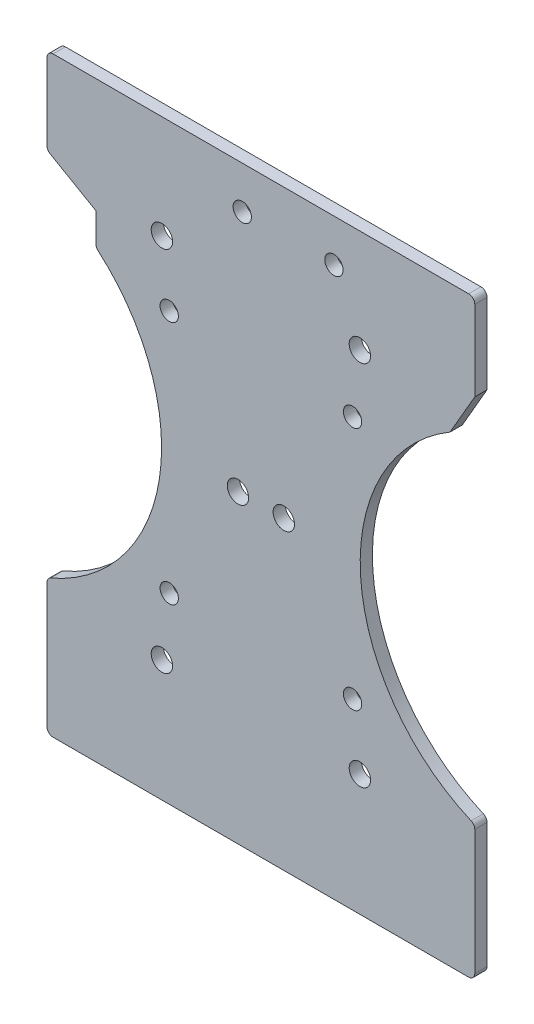
ISO-10303-21;
HEADER;
FILE_DESCRIPTION(('STEP AP214'),'2;1');
FILE_NAME('part.step','',(''),(''),'','','');
FILE_SCHEMA(('AUTOMOTIVE_DESIGN { 1 0 10303 214 1 1 1 1 }'));
ENDSEC;
DATA;
#1=APPLICATION_CONTEXT('core data for automotive mechanical design processes');
#2=APPLICATION_PROTOCOL_DEFINITION('international standard','automotive_design',2000,#1);
#3=PRODUCT_CONTEXT('',#1,'mechanical');
#4=PRODUCT('Part','Part','',(#3));
#5=PRODUCT_RELATED_PRODUCT_CATEGORY('part','',(#4));
#6=PRODUCT_DEFINITION_FORMATION('','',#4);
#7=PRODUCT_DEFINITION_CONTEXT('part definition',#1,'design');
#8=PRODUCT_DEFINITION('design','',#6,#7);
#9=PRODUCT_DEFINITION_SHAPE('','',#8);
#10=(LENGTH_UNIT() NAMED_UNIT(*) SI_UNIT(.MILLI.,.METRE.));
#11=(NAMED_UNIT(*) PLANE_ANGLE_UNIT() SI_UNIT($,.RADIAN.));
#12=(NAMED_UNIT(*) SI_UNIT($,.STERADIAN.) SOLID_ANGLE_UNIT());
#13=UNCERTAINTY_MEASURE_WITH_UNIT(LENGTH_MEASURE(1.E-05),#10,'distance_accuracy_value','');
#14=(GEOMETRIC_REPRESENTATION_CONTEXT(3) GLOBAL_UNCERTAINTY_ASSIGNED_CONTEXT((#13)) GLOBAL_UNIT_ASSIGNED_CONTEXT((#10,
#11,#12)) REPRESENTATION_CONTEXT('',''));
#15=CARTESIAN_POINT('',(0.,0.,0.));
#16=DIRECTION('',(0.,0.,1.));
#17=DIRECTION('',(1.,0.,0.));
#18=AXIS2_PLACEMENT_3D('',#15,#16,#17);
#19=CARTESIAN_POINT('',(46.25,0.,2.));
#20=DIRECTION('',(0.,0.,-1.));
#21=DIRECTION('',(-1.,0.,0.));
#22=AXIS2_PLACEMENT_3D('',#19,#20,#21);
#23=CYLINDRICAL_SURFACE('',#22,30.);
#24=CARTESIAN_POINT('',(46.25,0.,2.));
#25=DIRECTION('',(0.,0.,1.));
#26=DIRECTION('',(1.,0.,0.));
#27=AXIS2_PLACEMENT_3D('',#24,#25,#26);
#28=CIRCLE('',#27,30.);
#29=CARTESIAN_POINT('',(30.9581567377026,25.8100664400797,2.));
#30=VERTEX_POINT('',#29);
#31=CARTESIAN_POINT('',(34.3951612903226,-27.5583526207125,2.));
#32=VERTEX_POINT('',#31);
#33=EDGE_CURVE('E176',#30,#32,#28,.T.);
#34=ORIENTED_EDGE('',*,*,#33,.T.);
#35=DIRECTION('',(0.,0.,-1.));
#36=VECTOR('',#35,1.);
#37=CARTESIAN_POINT('',(34.3951612903226,-27.5583526207125,2.));
#38=LINE('',#37,#36);
#39=CARTESIAN_POINT('',(34.3951612903226,-27.5583526207125,0.));
#40=VERTEX_POINT('',#39);
#41=EDGE_CURVE('E184',#32,#40,#38,.T.);
#42=ORIENTED_EDGE('',*,*,#41,.T.);
#43=CARTESIAN_POINT('',(46.25,0.,0.));
#44=DIRECTION('',(0.,0.,1.));
#45=DIRECTION('',(1.,0.,0.));
#46=AXIS2_PLACEMENT_3D('',#43,#44,#45);
#47=CIRCLE('',#46,30.);
#48=CARTESIAN_POINT('',(30.9581567377026,25.8100664400797,0.));
#49=VERTEX_POINT('',#48);
#50=EDGE_CURVE('E179',#49,#40,#47,.T.);
#51=ORIENTED_EDGE('',*,*,#50,.F.);
#52=DIRECTION('',(0.,0.,-1.));
#53=VECTOR('',#52,1.);
#54=CARTESIAN_POINT('',(30.9581567377026,25.8100664400797,2.));
#55=LINE('',#54,#53);
#56=EDGE_CURVE('E173',#30,#49,#55,.T.);
#57=ORIENTED_EDGE('',*,*,#56,.F.);
#58=EDGE_LOOP('',(#34,#42,#51,#57));
#59=FACE_BOUND('',#58,.T.);
#60=ADVANCED_FACE('F41',(#59),#23,.F.);
#61=CARTESIAN_POINT('',(12.0425309480404,-6.9527584845755,2.));
#62=DIRECTION('',(0.86602540378444,-0.499999999999998,0.));
#63=DIRECTION('',(0.499999999999998,0.86602540378444,0.));
#64=AXIS2_PLACEMENT_3D('',#61,#62,#63);
#65=PLANE('',#64);
#66=DIRECTION('',(-0.499999999999998,-0.86602540378444,0.));
#67=VECTOR('',#66,1.);
#68=CARTESIAN_POINT('',(12.0425309480404,-6.9527584845755,0.));
#69=LINE('',#68,#67);
#70=CARTESIAN_POINT('',(35.0000000000001,32.8107443266089,0.));
#71=VERTEX_POINT('',#70);
#72=EDGE_CURVE('E250',#71,#49,#69,.T.);
#73=ORIENTED_EDGE('',*,*,#72,.F.);
#74=DIRECTION('',(0.,0.,-1.));
#75=VECTOR('',#74,1.);
#76=CARTESIAN_POINT('',(35.0000000000001,32.8107443266089,2.));
#77=LINE('',#76,#75);
#78=CARTESIAN_POINT('',(35.0000000000001,32.8107443266089,2.));
#79=VERTEX_POINT('',#78);
#80=EDGE_CURVE('E185',#79,#71,#77,.T.);
#81=ORIENTED_EDGE('',*,*,#80,.F.);
#82=DIRECTION('',(-0.499999999999998,-0.86602540378444,0.));
#83=VECTOR('',#82,1.);
#84=CARTESIAN_POINT('',(12.0425309480404,-6.9527584845755,2.));
#85=LINE('',#84,#83);
#86=EDGE_CURVE('E191',#79,#30,#85,.T.);
#87=ORIENTED_EDGE('',*,*,#86,.T.);
#88=ORIENTED_EDGE('',*,*,#56,.T.);
#89=EDGE_LOOP('',(#73,#81,#87,#88));
#90=FACE_BOUND('',#89,.T.);
#91=ADVANCED_FACE('F197',(#90),#65,.T.);
#92=CARTESIAN_POINT('',(35.,0.,2.));
#93=DIRECTION('',(1.,0.,0.));
#94=DIRECTION('',(0.,1.,0.));
#95=AXIS2_PLACEMENT_3D('',#92,#93,#94);
#96=PLANE('',#95);
#97=DIRECTION('',(0.,-1.,0.));
#98=VECTOR('',#97,1.);
#99=CARTESIAN_POINT('',(35.,0.,0.));
#100=LINE('',#99,#98);
#101=CARTESIAN_POINT('',(35.0000000000001,45.9201449273124,0.));
#102=VERTEX_POINT('',#101);
#103=EDGE_CURVE('E252',#102,#71,#100,.T.);
#104=ORIENTED_EDGE('',*,*,#103,.F.);
#105=DIRECTION('',(0.,0.,-1.));
#106=VECTOR('',#105,1.);
#107=CARTESIAN_POINT('',(35.0000000000001,45.9201449273124,2.));
#108=LINE('',#107,#106);
#109=CARTESIAN_POINT('',(35.0000000000001,45.9201449273124,2.));
#110=VERTEX_POINT('',#109);
#111=EDGE_CURVE('E11',#102,#110,#108,.F.);
#112=ORIENTED_EDGE('',*,*,#111,.T.);
#113=DIRECTION('',(0.,-1.,0.));
#114=VECTOR('',#113,1.);
#115=CARTESIAN_POINT('',(35.,0.,2.));
#116=LINE('',#115,#114);
#117=EDGE_CURVE('E199',#110,#79,#116,.T.);
#118=ORIENTED_EDGE('',*,*,#117,.T.);
#119=ORIENTED_EDGE('',*,*,#80,.T.);
#120=EDGE_LOOP('',(#104,#112,#118,#119));
#121=FACE_BOUND('',#120,.T.);
#122=ADVANCED_FACE('F482',(#121),#96,.T.);
#123=CARTESIAN_POINT('',(0.,46.9201449273124,2.));
#124=DIRECTION('',(0.,-1.,0.));
#125=DIRECTION('',(0.,0.,-1.));
#126=AXIS2_PLACEMENT_3D('',#123,#124,#125);
#127=PLANE('',#126);
#128=DIRECTION('',(-1.,0.,0.));
#129=VECTOR('',#128,1.);
#130=CARTESIAN_POINT('',(0.,46.9201449273124,0.));
#131=LINE('',#130,#129);
#132=CARTESIAN_POINT('',(34.0000000000001,46.9201449273124,0.));
#133=VERTEX_POINT('',#132);
#134=CARTESIAN_POINT('',(-34.,46.9201449273124,0.));
#135=VERTEX_POINT('',#134);
#136=EDGE_CURVE('E254',#133,#135,#131,.T.);
#137=ORIENTED_EDGE('',*,*,#136,.T.);
#138=DIRECTION('',(0.,0.,-1.));
#139=VECTOR('',#138,1.);
#140=CARTESIAN_POINT('',(-34.,46.9201449273124,2.));
#141=LINE('',#140,#139);
#142=CARTESIAN_POINT('',(-34.,46.9201449273124,2.));
#143=VERTEX_POINT('',#142);
#144=EDGE_CURVE('E49',#135,#143,#141,.F.);
#145=ORIENTED_EDGE('',*,*,#144,.T.);
#146=DIRECTION('',(1.,0.,0.));
#147=VECTOR('',#146,1.);
#148=CARTESIAN_POINT('',(0.,46.9201449273124,2.));
#149=LINE('',#148,#147);
#150=CARTESIAN_POINT('',(34.0000000000001,46.9201449273124,2.));
#151=VERTEX_POINT('',#150);
#152=EDGE_CURVE('E201',#143,#151,#149,.T.);
#153=ORIENTED_EDGE('',*,*,#152,.T.);
#154=DIRECTION('',(0.,0.,-1.));
#155=VECTOR('',#154,1.);
#156=CARTESIAN_POINT('',(34.0000000000001,46.9201449273124,0.));
#157=LINE('',#156,#155);
#158=EDGE_CURVE('E345',#151,#133,#157,.T.);
#159=ORIENTED_EDGE('',*,*,#158,.T.);
#160=EDGE_LOOP('',(#137,#145,#153,#159));
#161=FACE_BOUND('',#160,.T.);
#162=ADVANCED_FACE('F350',(#161),#127,.F.);
#163=CARTESIAN_POINT('',(-35.,0.,2.));
#164=DIRECTION('',(1.,0.,0.));
#165=DIRECTION('',(0.,1.,0.));
#166=AXIS2_PLACEMENT_3D('',#163,#164,#165);
#167=PLANE('',#166);
#168=DIRECTION('',(0.,-1.,0.));
#169=VECTOR('',#168,1.);
#170=CARTESIAN_POINT('',(-35.,0.,0.));
#171=LINE('',#170,#169);
#172=CARTESIAN_POINT('',(-35.,45.9201449273124,0.));
#173=VERTEX_POINT('',#172);
#174=CARTESIAN_POINT('',(-35.,33.3880945957984,0.));
#175=VERTEX_POINT('',#174);
#176=EDGE_CURVE('E257',#173,#175,#171,.T.);
#177=ORIENTED_EDGE('',*,*,#176,.T.);
#178=DIRECTION('',(0.,0.,-1.));
#179=VECTOR('',#178,1.);
#180=CARTESIAN_POINT('',(-35.,33.3880945957984,2.));
#181=LINE('',#180,#179);
#182=CARTESIAN_POINT('',(-35.,33.3880945957984,2.));
#183=VERTEX_POINT('',#182);
#184=EDGE_CURVE('E343',#175,#183,#181,.F.);
#185=ORIENTED_EDGE('',*,*,#184,.T.);
#186=DIRECTION('',(0.,-1.,0.));
#187=VECTOR('',#186,1.);
#188=CARTESIAN_POINT('',(-35.,0.,2.));
#189=LINE('',#188,#187);
#190=CARTESIAN_POINT('',(-35.,45.9201449273124,2.));
#191=VERTEX_POINT('',#190);
#192=EDGE_CURVE('E207',#191,#183,#189,.T.);
#193=ORIENTED_EDGE('',*,*,#192,.F.);
#194=DIRECTION('',(0.,0.,-1.));
#195=VECTOR('',#194,1.);
#196=CARTESIAN_POINT('',(-35.,45.9201449273124,2.));
#197=LINE('',#196,#195);
#198=EDGE_CURVE('E340',#191,#173,#197,.T.);
#199=ORIENTED_EDGE('',*,*,#198,.T.);
#200=EDGE_LOOP('',(#177,#185,#193,#199));
#201=FACE_BOUND('',#200,.T.);
#202=ADVANCED_FACE('F361',(#201),#167,.F.);
#203=CARTESIAN_POINT('',(5.45746905195967,9.45261367872892,2.));
#204=DIRECTION('',(0.5,0.866025403784439,0.));
#205=DIRECTION('',(-0.866025403784439,0.5,0.));
#206=AXIS2_PLACEMENT_3D('',#203,#204,#205);
#207=PLANE('',#206);
#208=DIRECTION('',(0.866025403784439,-0.5,0.));
#209=VECTOR('',#208,1.);
#210=CARTESIAN_POINT('',(5.45746905195967,9.45261367872892,2.));
#211=LINE('',#210,#209);
#212=CARTESIAN_POINT('',(-34.5,32.522069192014,2.));
#213=VERTEX_POINT('',#212);
#214=CARTESIAN_POINT('',(-27.,28.1919421730918,2.));
#215=VERTEX_POINT('',#214);
#216=EDGE_CURVE('E210',#213,#215,#211,.T.);
#217=ORIENTED_EDGE('',*,*,#216,.F.);
#218=DIRECTION('',(0.,0.,-1.));
#219=VECTOR('',#218,1.);
#220=CARTESIAN_POINT('',(-34.5,32.522069192014,2.));
#221=LINE('',#220,#219);
#222=CARTESIAN_POINT('',(-34.5,32.522069192014,0.));
#223=VERTEX_POINT('',#222);
#224=EDGE_CURVE('E337',#213,#223,#221,.T.);
#225=ORIENTED_EDGE('',*,*,#224,.T.);
#226=DIRECTION('',(0.866025403784439,-0.5,0.));
#227=VECTOR('',#226,1.);
#228=CARTESIAN_POINT('',(5.45746905195967,9.45261367872892,0.));
#229=LINE('',#228,#227);
#230=CARTESIAN_POINT('',(-27.,28.1919421730918,0.));
#231=VERTEX_POINT('',#230);
#232=EDGE_CURVE('E260',#223,#231,#229,.T.);
#233=ORIENTED_EDGE('',*,*,#232,.T.);
#234=DIRECTION('',(0.,0.,-1.));
#235=VECTOR('',#234,1.);
#236=CARTESIAN_POINT('',(-27.,28.1919421730918,2.));
#237=LINE('',#236,#235);
#238=EDGE_CURVE('E229',#215,#231,#237,.T.);
#239=ORIENTED_EDGE('',*,*,#238,.F.);
#240=EDGE_LOOP('',(#217,#225,#233,#239));
#241=FACE_BOUND('',#240,.T.);
#242=ADVANCED_FACE('F374',(#241),#207,.F.);
#243=CARTESIAN_POINT('',(-27.,0.,2.));
#244=DIRECTION('',(1.,0.,0.));
#245=DIRECTION('',(0.,0.,-1.));
#246=AXIS2_PLACEMENT_3D('',#243,#244,#245);
#247=PLANE('',#246);
#248=DIRECTION('',(0.,-1.,0.));
#249=VECTOR('',#248,1.);
#250=CARTESIAN_POINT('',(-27.,0.,0.));
#251=LINE('',#250,#249);
#252=CARTESIAN_POINT('',(-27.,23.4720578560978,0.));
#253=VERTEX_POINT('',#252);
#254=EDGE_CURVE('E262',#231,#253,#251,.T.);
#255=ORIENTED_EDGE('',*,*,#254,.T.);
#256=DIRECTION('',(0.,0.,1.));
#257=VECTOR('',#256,1.);
#258=CARTESIAN_POINT('',(-27.,23.4720578560978,2.));
#259=LINE('',#258,#257);
#260=CARTESIAN_POINT('',(-27.,23.4720578560978,2.));
#261=VERTEX_POINT('',#260);
#262=EDGE_CURVE('E335',#253,#261,#259,.T.);
#263=ORIENTED_EDGE('',*,*,#262,.T.);
#264=DIRECTION('',(0.,-1.,0.));
#265=VECTOR('',#264,1.);
#266=CARTESIAN_POINT('',(-27.,0.,2.));
#267=LINE('',#266,#265);
#268=EDGE_CURVE('E212',#215,#261,#267,.T.);
#269=ORIENTED_EDGE('',*,*,#268,.F.);
#270=ORIENTED_EDGE('',*,*,#238,.T.);
#271=EDGE_LOOP('',(#255,#263,#269,#270));
#272=FACE_BOUND('',#271,.T.);
#273=ADVANCED_FACE('F379',(#272),#247,.F.);
#274=CARTESIAN_POINT('',(-46.25,0.,2.));
#275=DIRECTION('',(0.,0.,-1.));
#276=DIRECTION('',(-1.,0.,0.));
#277=AXIS2_PLACEMENT_3D('',#274,#275,#276);
#278=CYLINDRICAL_SURFACE('',#277,30.);
#279=CARTESIAN_POINT('',(-46.25,0.,0.));
#280=DIRECTION('',(0.,0.,1.));
#281=DIRECTION('',(1.,0.,0.));
#282=AXIS2_PLACEMENT_3D('',#279,#280,#281);
#283=CIRCLE('',#282,30.);
#284=CARTESIAN_POINT('',(-34.3951612903226,-27.5583526207126,0.));
#285=VERTEX_POINT('',#284);
#286=CARTESIAN_POINT('',(-26.6532258064516,22.7148946994494,0.));
#287=VERTEX_POINT('',#286);
#288=EDGE_CURVE('E265',#285,#287,#283,.T.);
#289=ORIENTED_EDGE('',*,*,#288,.F.);
#290=DIRECTION('',(0.,0.,-1.));
#291=VECTOR('',#290,1.);
#292=CARTESIAN_POINT('',(-34.3951612903226,-27.5583526207126,2.));
#293=LINE('',#292,#291);
#294=CARTESIAN_POINT('',(-34.3951612903226,-27.5583526207126,2.));
#295=VERTEX_POINT('',#294);
#296=EDGE_CURVE('E333',#285,#295,#293,.F.);
#297=ORIENTED_EDGE('',*,*,#296,.T.);
#298=CARTESIAN_POINT('',(-46.25,0.,2.));
#299=DIRECTION('',(0.,0.,1.));
#300=DIRECTION('',(1.,0.,0.));
#301=AXIS2_PLACEMENT_3D('',#298,#299,#300);
#302=CIRCLE('',#301,30.);
#303=CARTESIAN_POINT('',(-26.6532258064516,22.7148946994494,2.));
#304=VERTEX_POINT('',#303);
#305=EDGE_CURVE('E215',#295,#304,#302,.T.);
#306=ORIENTED_EDGE('',*,*,#305,.T.);
#307=DIRECTION('',(0.,0.,-1.));
#308=VECTOR('',#307,1.);
#309=CARTESIAN_POINT('',(-26.6532258064516,22.7148946994494,2.));
#310=LINE('',#309,#308);
#311=EDGE_CURVE('E330',#304,#287,#310,.T.);
#312=ORIENTED_EDGE('',*,*,#311,.T.);
#313=EDGE_LOOP('',(#289,#297,#306,#312));
#314=FACE_BOUND('',#313,.T.);
#315=ADVANCED_FACE('F388',(#314),#278,.F.);
#316=CARTESIAN_POINT('',(-35.,0.,2.));
#317=DIRECTION('',(1.,0.,0.));
#318=DIRECTION('',(0.,1.,0.));
#319=AXIS2_PLACEMENT_3D('',#316,#317,#318);
#320=PLANE('',#319);
#321=DIRECTION('',(0.,-1.,0.));
#322=VECTOR('',#321,1.);
#323=CARTESIAN_POINT('',(-35.,0.,0.));
#324=LINE('',#323,#322);
#325=CARTESIAN_POINT('',(-35.,-28.4769643747363,0.));
#326=VERTEX_POINT('',#325);
#327=CARTESIAN_POINT('',(-35.,-48.9201449273124,0.));
#328=VERTEX_POINT('',#327);
#329=EDGE_CURVE('E268',#326,#328,#324,.T.);
#330=ORIENTED_EDGE('',*,*,#329,.T.);
#331=DIRECTION('',(0.,0.,-1.));
#332=VECTOR('',#331,1.);
#333=CARTESIAN_POINT('',(-35.,-48.9201449273124,2.));
#334=LINE('',#333,#332);
#335=CARTESIAN_POINT('',(-35.,-48.9201449273124,2.));
#336=VERTEX_POINT('',#335);
#337=EDGE_CURVE('E328',#328,#336,#334,.F.);
#338=ORIENTED_EDGE('',*,*,#337,.T.);
#339=DIRECTION('',(0.,-1.,0.));
#340=VECTOR('',#339,1.);
#341=CARTESIAN_POINT('',(-35.,0.,2.));
#342=LINE('',#341,#340);
#343=CARTESIAN_POINT('',(-35.,-28.4769643747363,2.));
#344=VERTEX_POINT('',#343);
#345=EDGE_CURVE('E218',#344,#336,#342,.T.);
#346=ORIENTED_EDGE('',*,*,#345,.F.);
#347=DIRECTION('',(0.,0.,1.));
#348=VECTOR('',#347,1.);
#349=CARTESIAN_POINT('',(-35.,-28.4769643747363,0.));
#350=LINE('',#349,#348);
#351=EDGE_CURVE('E325',#344,#326,#350,.F.);
#352=ORIENTED_EDGE('',*,*,#351,.T.);
#353=EDGE_LOOP('',(#330,#338,#346,#352));
#354=FACE_BOUND('',#353,.T.);
#355=ADVANCED_FACE('F395',(#354),#320,.F.);
#356=CARTESIAN_POINT('',(-3.05,40.,2.));
#357=DIRECTION('',(0.,0.,-1.));
#358=DIRECTION('',(-1.,0.,0.));
#359=AXIS2_PLACEMENT_3D('',#356,#357,#358);
#360=CYLINDRICAL_SURFACE('',#359,1.5);
#361=CARTESIAN_POINT('',(-3.05,40.,2.));
#362=DIRECTION('',(0.,0.,1.));
#363=DIRECTION('',(1.,0.,0.));
#364=AXIS2_PLACEMENT_3D('',#361,#362,#363);
#365=CIRCLE('',#364,1.5);
#366=CARTESIAN_POINT('',(-1.55,40.,2.));
#367=VERTEX_POINT('',#366);
#368=EDGE_CURVE('E223',#367,#367,#365,.T.);
#369=ORIENTED_EDGE('',*,*,#368,.T.);
#370=EDGE_LOOP('',(#369));
#371=FACE_BOUND('',#370,.T.);
#372=CARTESIAN_POINT('',(-3.05,40.,0.));
#373=DIRECTION('',(0.,0.,1.));
#374=DIRECTION('',(1.,0.,0.));
#375=AXIS2_PLACEMENT_3D('',#372,#373,#374);
#376=CIRCLE('',#375,1.5);
#377=CARTESIAN_POINT('',(-1.55,40.,0.));
#378=VERTEX_POINT('',#377);
#379=EDGE_CURVE('E274',#378,#378,#376,.T.);
#380=ORIENTED_EDGE('',*,*,#379,.F.);
#381=EDGE_LOOP('',(#380));
#382=FACE_BOUND('',#381,.T.);
#383=ADVANCED_FACE('F533',(#371,#382),#360,.F.);
#384=CARTESIAN_POINT('',(35.,0.,2.));
#385=DIRECTION('',(1.,0.,0.));
#386=DIRECTION('',(0.,1.,0.));
#387=AXIS2_PLACEMENT_3D('',#384,#385,#386);
#388=PLANE('',#387);
#389=DIRECTION('',(0.,-1.,0.));
#390=VECTOR('',#389,1.);
#391=CARTESIAN_POINT('',(35.,0.,0.));
#392=LINE('',#391,#390);
#393=CARTESIAN_POINT('',(35.0000000000001,-28.4769643747363,0.));
#394=VERTEX_POINT('',#393);
#395=CARTESIAN_POINT('',(35.0000000000001,-48.9201449273124,0.));
#396=VERTEX_POINT('',#395);
#397=EDGE_CURVE('E271',#394,#396,#392,.T.);
#398=ORIENTED_EDGE('',*,*,#397,.F.);
#399=DIRECTION('',(0.,0.,-1.));
#400=VECTOR('',#399,1.);
#401=CARTESIAN_POINT('',(35.0000000000001,-28.4769643747363,2.));
#402=LINE('',#401,#400);
#403=CARTESIAN_POINT('',(35.0000000000001,-28.4769643747363,2.));
#404=VERTEX_POINT('',#403);
#405=EDGE_CURVE('E304',#394,#404,#402,.F.);
#406=ORIENTED_EDGE('',*,*,#405,.T.);
#407=DIRECTION('',(0.,-1.,0.));
#408=VECTOR('',#407,1.);
#409=CARTESIAN_POINT('',(35.,0.,2.));
#410=LINE('',#409,#408);
#411=CARTESIAN_POINT('',(35.0000000000001,-48.9201449273124,2.));
#412=VERTEX_POINT('',#411);
#413=EDGE_CURVE('E220',#404,#412,#410,.T.);
#414=ORIENTED_EDGE('',*,*,#413,.T.);
#415=DIRECTION('',(0.,0.,-1.));
#416=VECTOR('',#415,1.);
#417=CARTESIAN_POINT('',(35.0000000000001,-48.9201449273124,2.));
#418=LINE('',#417,#416);
#419=EDGE_CURVE('E301',#412,#396,#418,.T.);
#420=ORIENTED_EDGE('',*,*,#419,.T.);
#421=EDGE_LOOP('',(#398,#406,#414,#420));
#422=FACE_BOUND('',#421,.T.);
#423=ADVANCED_FACE('F456',(#422),#388,.T.);
#424=CARTESIAN_POINT('',(3.75000000000001,0.,2.));
#425=DIRECTION('',(0.,0.,-1.));
#426=DIRECTION('',(-1.,0.,0.));
#427=AXIS2_PLACEMENT_3D('',#424,#425,#426);
#428=CYLINDRICAL_SURFACE('',#427,1.75);
#429=CARTESIAN_POINT('',(3.75000000000001,0.,2.));
#430=DIRECTION('',(0.,0.,1.));
#431=DIRECTION('',(1.,0.,0.));
#432=AXIS2_PLACEMENT_3D('',#429,#430,#431);
#433=CIRCLE('',#432,1.75);
#434=CARTESIAN_POINT('',(5.50000000000002,0.,2.));
#435=VERTEX_POINT('',#434);
#436=EDGE_CURVE('E194',#435,#435,#433,.F.);
#437=ORIENTED_EDGE('',*,*,#436,.F.);
#438=EDGE_LOOP('',(#437));
#439=FACE_BOUND('',#438,.T.);
#440=CARTESIAN_POINT('',(3.75000000000001,0.,0.));
#441=DIRECTION('',(0.,0.,1.));
#442=DIRECTION('',(1.,0.,0.));
#443=AXIS2_PLACEMENT_3D('',#440,#441,#442);
#444=CIRCLE('',#443,1.75);
#445=CARTESIAN_POINT('',(5.50000000000002,0.,0.));
#446=VERTEX_POINT('',#445);
#447=EDGE_CURVE('E246',#446,#446,#444,.F.);
#448=ORIENTED_EDGE('',*,*,#447,.T.);
#449=EDGE_LOOP('',(#448));
#450=FACE_BOUND('',#449,.T.);
#451=ADVANCED_FACE('F452',(#439,#450),#428,.F.);
#452=CARTESIAN_POINT('',(-3.74999999999998,0.,2.));
#453=DIRECTION('',(0.,0.,-1.));
#454=DIRECTION('',(-1.,0.,0.));
#455=AXIS2_PLACEMENT_3D('',#452,#453,#454);
#456=CYLINDRICAL_SURFACE('',#455,1.75);
#457=CARTESIAN_POINT('',(-3.74999999999998,0.,2.));
#458=DIRECTION('',(0.,0.,1.));
#459=DIRECTION('',(1.,0.,0.));
#460=AXIS2_PLACEMENT_3D('',#457,#458,#459);
#461=CIRCLE('',#460,1.75);
#462=CARTESIAN_POINT('',(-1.99999999999997,0.,2.));
#463=VERTEX_POINT('',#462);
#464=EDGE_CURVE('E445',#463,#463,#461,.T.);
#465=ORIENTED_EDGE('',*,*,#464,.T.);
#466=EDGE_LOOP('',(#465));
#467=FACE_BOUND('',#466,.T.);
#468=CARTESIAN_POINT('',(-3.74999999999998,0.,0.));
#469=DIRECTION('',(0.,0.,1.));
#470=DIRECTION('',(1.,0.,0.));
#471=AXIS2_PLACEMENT_3D('',#468,#469,#470);
#472=CIRCLE('',#471,1.75);
#473=CARTESIAN_POINT('',(-1.99999999999997,0.,0.));
#474=VERTEX_POINT('',#473);
#475=EDGE_CURVE('E243',#474,#474,#472,.T.);
#476=ORIENTED_EDGE('',*,*,#475,.F.);
#477=EDGE_LOOP('',(#476));
#478=FACE_BOUND('',#477,.T.);
#479=ADVANCED_FACE('F455',(#467,#478),#456,.F.);
#480=CARTESIAN_POINT('',(-16.1979617995718,30.0520382004283,2.));
#481=DIRECTION('',(0.,0.,-1.));
#482=DIRECTION('',(-1.,0.,0.));
#483=AXIS2_PLACEMENT_3D('',#480,#481,#482);
#484=CYLINDRICAL_SURFACE('',#483,1.75);
#485=CARTESIAN_POINT('',(-16.1979617995718,30.0520382004283,2.));
#486=DIRECTION('',(0.,0.,1.));
#487=DIRECTION('',(1.,0.,0.));
#488=AXIS2_PLACEMENT_3D('',#485,#486,#487);
#489=CIRCLE('',#488,1.75);
#490=CARTESIAN_POINT('',(-14.4479617995718,30.0520382004283,2.));
#491=VERTEX_POINT('',#490);
#492=EDGE_CURVE('E442',#491,#491,#489,.T.);
#493=ORIENTED_EDGE('',*,*,#492,.T.);
#494=EDGE_LOOP('',(#493));
#495=FACE_BOUND('',#494,.T.);
#496=CARTESIAN_POINT('',(-16.1979617995718,30.0520382004283,0.));
#497=DIRECTION('',(0.,0.,1.));
#498=DIRECTION('',(1.,0.,0.));
#499=AXIS2_PLACEMENT_3D('',#496,#497,#498);
#500=CIRCLE('',#499,1.75);
#501=CARTESIAN_POINT('',(-14.4479617995718,30.0520382004283,0.));
#502=VERTEX_POINT('',#501);
#503=EDGE_CURVE('E240',#502,#502,#500,.T.);
#504=ORIENTED_EDGE('',*,*,#503,.F.);
#505=EDGE_LOOP('',(#504));
#506=FACE_BOUND('',#505,.T.);
#507=ADVANCED_FACE('F488',(#495,#506),#484,.F.);
#508=CARTESIAN_POINT('',(-16.1979617995718,-30.0520382004283,2.));
#509=DIRECTION('',(0.,0.,-1.));
#510=DIRECTION('',(-1.,0.,0.));
#511=AXIS2_PLACEMENT_3D('',#508,#509,#510);
#512=CYLINDRICAL_SURFACE('',#511,1.75);
#513=CARTESIAN_POINT('',(-16.1979617995718,-30.0520382004283,2.));
#514=DIRECTION('',(0.,0.,1.));
#515=DIRECTION('',(1.,0.,0.));
#516=AXIS2_PLACEMENT_3D('',#513,#514,#515);
#517=CIRCLE('',#516,1.75);
#518=CARTESIAN_POINT('',(-14.4479617995718,-30.0520382004283,2.));
#519=VERTEX_POINT('',#518);
#520=EDGE_CURVE('E439',#519,#519,#517,.T.);
#521=ORIENTED_EDGE('',*,*,#520,.T.);
#522=EDGE_LOOP('',(#521));
#523=FACE_BOUND('',#522,.T.);
#524=CARTESIAN_POINT('',(-16.1979617995718,-30.0520382004283,0.));
#525=DIRECTION('',(0.,0.,1.));
#526=DIRECTION('',(1.,0.,0.));
#527=AXIS2_PLACEMENT_3D('',#524,#525,#526);
#528=CIRCLE('',#527,1.75);
#529=CARTESIAN_POINT('',(-14.4479617995718,-30.0520382004283,0.));
#530=VERTEX_POINT('',#529);
#531=EDGE_CURVE('E237',#530,#530,#528,.T.);
#532=ORIENTED_EDGE('',*,*,#531,.F.);
#533=EDGE_LOOP('',(#532));
#534=FACE_BOUND('',#533,.T.);
#535=ADVANCED_FACE('F492',(#523,#534),#512,.F.);
#536=CARTESIAN_POINT('',(16.1979617995718,-30.0520382004283,2.));
#537=DIRECTION('',(0.,0.,-1.));
#538=DIRECTION('',(-1.,0.,0.));
#539=AXIS2_PLACEMENT_3D('',#536,#537,#538);
#540=CYLINDRICAL_SURFACE('',#539,1.75);
#541=CARTESIAN_POINT('',(16.1979617995718,-30.0520382004283,2.));
#542=DIRECTION('',(0.,0.,1.));
#543=DIRECTION('',(1.,0.,0.));
#544=AXIS2_PLACEMENT_3D('',#541,#542,#543);
#545=CIRCLE('',#544,1.75);
#546=CARTESIAN_POINT('',(17.9479617995718,-30.0520382004283,2.));
#547=VERTEX_POINT('',#546);
#548=EDGE_CURVE('E436',#547,#547,#545,.F.);
#549=ORIENTED_EDGE('',*,*,#548,.F.);
#550=EDGE_LOOP('',(#549));
#551=FACE_BOUND('',#550,.T.);
#552=CARTESIAN_POINT('',(16.1979617995718,-30.0520382004283,0.));
#553=DIRECTION('',(0.,0.,1.));
#554=DIRECTION('',(1.,0.,0.));
#555=AXIS2_PLACEMENT_3D('',#552,#553,#554);
#556=CIRCLE('',#555,1.75);
#557=CARTESIAN_POINT('',(17.9479617995718,-30.0520382004283,0.));
#558=VERTEX_POINT('',#557);
#559=EDGE_CURVE('E233',#558,#558,#556,.F.);
#560=ORIENTED_EDGE('',*,*,#559,.T.);
#561=EDGE_LOOP('',(#560));
#562=FACE_BOUND('',#561,.T.);
#563=ADVANCED_FACE('F496',(#551,#562),#540,.F.);
#564=CARTESIAN_POINT('',(16.1979617995718,30.0520382004283,2.));
#565=DIRECTION('',(0.,0.,-1.));
#566=DIRECTION('',(-1.,0.,0.));
#567=AXIS2_PLACEMENT_3D('',#564,#565,#566);
#568=CYLINDRICAL_SURFACE('',#567,1.75);
#569=CARTESIAN_POINT('',(16.1979617995718,30.0520382004283,2.));
#570=DIRECTION('',(0.,0.,1.));
#571=DIRECTION('',(1.,0.,0.));
#572=AXIS2_PLACEMENT_3D('',#569,#570,#571);
#573=CIRCLE('',#572,1.75);
#574=CARTESIAN_POINT('',(17.9479617995718,30.0520382004283,2.));
#575=VERTEX_POINT('',#574);
#576=EDGE_CURVE('E280',#575,#575,#573,.F.);
#577=ORIENTED_EDGE('',*,*,#576,.F.);
#578=EDGE_LOOP('',(#577));
#579=FACE_BOUND('',#578,.T.);
#580=CARTESIAN_POINT('',(16.1979617995718,30.0520382004283,0.));
#581=DIRECTION('',(0.,0.,1.));
#582=DIRECTION('',(1.,0.,0.));
#583=AXIS2_PLACEMENT_3D('',#580,#581,#582);
#584=CIRCLE('',#583,1.75);
#585=CARTESIAN_POINT('',(17.9479617995718,30.0520382004283,0.));
#586=VERTEX_POINT('',#585);
#587=EDGE_CURVE('E230',#586,#586,#584,.F.);
#588=ORIENTED_EDGE('',*,*,#587,.T.);
#589=EDGE_LOOP('',(#588));
#590=FACE_BOUND('',#589,.T.);
#591=ADVANCED_FACE('F500',(#579,#590),#568,.F.);
#592=CARTESIAN_POINT('',(11.95,40.,2.));
#593=DIRECTION('',(0.,0.,-1.));
#594=DIRECTION('',(-1.,0.,0.));
#595=AXIS2_PLACEMENT_3D('',#592,#593,#594);
#596=CYLINDRICAL_SURFACE('',#595,1.5);
#597=CARTESIAN_POINT('',(11.95,40.,2.));
#598=DIRECTION('',(0.,0.,1.));
#599=DIRECTION('',(1.,0.,0.));
#600=AXIS2_PLACEMENT_3D('',#597,#598,#599);
#601=CIRCLE('',#600,1.5);
#602=CARTESIAN_POINT('',(13.45,40.,2.));
#603=VERTEX_POINT('',#602);
#604=EDGE_CURVE('E226',#603,#603,#601,.F.);
#605=ORIENTED_EDGE('',*,*,#604,.F.);
#606=EDGE_LOOP('',(#605));
#607=FACE_BOUND('',#606,.T.);
#608=CARTESIAN_POINT('',(11.95,40.,0.));
#609=DIRECTION('',(0.,0.,1.));
#610=DIRECTION('',(1.,0.,0.));
#611=AXIS2_PLACEMENT_3D('',#608,#609,#610);
#612=CIRCLE('',#611,1.5);
#613=CARTESIAN_POINT('',(13.45,40.,0.));
#614=VERTEX_POINT('',#613);
#615=EDGE_CURVE('E277',#614,#614,#612,.F.);
#616=ORIENTED_EDGE('',*,*,#615,.T.);
#617=EDGE_LOOP('',(#616));
#618=FACE_BOUND('',#617,.T.);
#619=ADVANCED_FACE('F471',(#607,#618),#596,.F.);
#620=CARTESIAN_POINT('',(0.,0.,2.));
#621=DIRECTION('',(0.,0.,1.));
#622=DIRECTION('',(1.,0.,0.));
#623=AXIS2_PLACEMENT_3D('',#620,#621,#622);
#624=PLANE('',#623);
#625=CARTESIAN_POINT('',(15.,-20.,2.));
#626=DIRECTION('',(0.,0.,1.));
#627=DIRECTION('',(1.,0.,0.));
#628=AXIS2_PLACEMENT_3D('',#625,#626,#627);
#629=CIRCLE('',#628,1.5);
#630=CARTESIAN_POINT('',(16.5,-20.,2.));
#631=VERTEX_POINT('',#630);
#632=EDGE_CURVE('E234',#631,#631,#629,.T.);
#633=ORIENTED_EDGE('',*,*,#632,.F.);
#634=EDGE_LOOP('',(#633));
#635=FACE_BOUND('',#634,.T.);
#636=CARTESIAN_POINT('',(-14.9999999999999,-20.,2.));
#637=DIRECTION('',(0.,0.,1.));
#638=DIRECTION('',(1.,0.,0.));
#639=AXIS2_PLACEMENT_3D('',#636,#637,#638);
#640=CIRCLE('',#639,1.5);
#641=CARTESIAN_POINT('',(-13.4999999999999,-20.,2.));
#642=VERTEX_POINT('',#641);
#643=EDGE_CURVE('E429',#642,#642,#640,.T.);
#644=ORIENTED_EDGE('',*,*,#643,.F.);
#645=EDGE_LOOP('',(#644));
#646=FACE_BOUND('',#645,.T.);
#647=CARTESIAN_POINT('',(-15.,20.,2.));
#648=DIRECTION('',(0.,0.,1.));
#649=DIRECTION('',(1.,0.,0.));
#650=AXIS2_PLACEMENT_3D('',#647,#648,#649);
#651=CIRCLE('',#650,1.5);
#652=CARTESIAN_POINT('',(-13.5,20.,2.));
#653=VERTEX_POINT('',#652);
#654=EDGE_CURVE('E426',#653,#653,#651,.T.);
#655=ORIENTED_EDGE('',*,*,#654,.F.);
#656=EDGE_LOOP('',(#655));
#657=FACE_BOUND('',#656,.T.);
#658=CARTESIAN_POINT('',(15.,20.,2.));
#659=DIRECTION('',(0.,0.,1.));
#660=DIRECTION('',(1.,0.,0.));
#661=AXIS2_PLACEMENT_3D('',#658,#659,#660);
#662=CIRCLE('',#661,1.5);
#663=CARTESIAN_POINT('',(16.5,20.,2.));
#664=VERTEX_POINT('',#663);
#665=EDGE_CURVE('E423',#664,#664,#662,.T.);
#666=ORIENTED_EDGE('',*,*,#665,.F.);
#667=EDGE_LOOP('',(#666));
#668=FACE_BOUND('',#667,.T.);
#669=ORIENTED_EDGE('',*,*,#413,.F.);
#670=CARTESIAN_POINT('',(34.0000000000001,-28.4769643747363,2.));
#671=DIRECTION('',(0.,0.,1.));
#672=DIRECTION('',(1.,0.,0.));
#673=AXIS2_PLACEMENT_3D('',#670,#671,#672);
#674=CIRCLE('',#673,1.);
#675=EDGE_CURVE('E193',#404,#32,#674,.T.);
#676=ORIENTED_EDGE('',*,*,#675,.T.);
#677=ORIENTED_EDGE('',*,*,#33,.F.);
#678=ORIENTED_EDGE('',*,*,#86,.F.);
#679=ORIENTED_EDGE('',*,*,#117,.F.);
#680=CARTESIAN_POINT('',(34.0000000000001,45.9201449273124,2.));
#681=DIRECTION('',(0.,0.,1.));
#682=DIRECTION('',(1.,0.,0.));
#683=AXIS2_PLACEMENT_3D('',#680,#681,#682);
#684=CIRCLE('',#683,1.);
#685=EDGE_CURVE('E306',#110,#151,#684,.T.);
#686=ORIENTED_EDGE('',*,*,#685,.T.);
#687=ORIENTED_EDGE('',*,*,#152,.F.);
#688=CARTESIAN_POINT('',(-34.,45.9201449273124,2.));
#689=DIRECTION('',(0.,0.,1.));
#690=DIRECTION('',(1.,0.,0.));
#691=AXIS2_PLACEMENT_3D('',#688,#689,#690);
#692=CIRCLE('',#691,1.);
#693=EDGE_CURVE('E308',#143,#191,#692,.T.);
#694=ORIENTED_EDGE('',*,*,#693,.T.);
#695=ORIENTED_EDGE('',*,*,#192,.T.);
#696=CARTESIAN_POINT('',(-34.,33.3880945957984,2.));
#697=DIRECTION('',(0.,0.,1.));
#698=DIRECTION('',(1.,0.,0.));
#699=AXIS2_PLACEMENT_3D('',#696,#697,#698);
#700=CIRCLE('',#699,1.);
#701=EDGE_CURVE('E310',#183,#213,#700,.T.);
#702=ORIENTED_EDGE('',*,*,#701,.T.);
#703=ORIENTED_EDGE('',*,*,#216,.T.);
#704=ORIENTED_EDGE('',*,*,#268,.T.);
#705=CARTESIAN_POINT('',(-26.,23.4720578560978,2.));
#706=DIRECTION('',(0.,0.,1.));
#707=DIRECTION('',(1.,0.,0.));
#708=AXIS2_PLACEMENT_3D('',#705,#706,#707);
#709=CIRCLE('',#708,1.);
#710=EDGE_CURVE('E312',#261,#304,#709,.T.);
#711=ORIENTED_EDGE('',*,*,#710,.T.);
#712=ORIENTED_EDGE('',*,*,#305,.F.);
#713=CARTESIAN_POINT('',(-34.,-28.4769643747363,2.));
#714=DIRECTION('',(0.,0.,1.));
#715=DIRECTION('',(1.,0.,0.));
#716=AXIS2_PLACEMENT_3D('',#713,#714,#715);
#717=CIRCLE('',#716,1.);
#718=EDGE_CURVE('E314',#295,#344,#717,.T.);
#719=ORIENTED_EDGE('',*,*,#718,.T.);
#720=ORIENTED_EDGE('',*,*,#345,.T.);
#721=CARTESIAN_POINT('',(-34.,-48.9201449273124,2.));
#722=DIRECTION('',(0.,0.,1.));
#723=DIRECTION('',(1.,0.,0.));
#724=AXIS2_PLACEMENT_3D('',#721,#722,#723);
#725=CIRCLE('',#724,1.);
#726=CARTESIAN_POINT('',(-34.,-49.9201449273124,2.));
#727=VERTEX_POINT('',#726);
#728=EDGE_CURVE('E62',#336,#727,#725,.T.);
#729=ORIENTED_EDGE('',*,*,#728,.T.);
#730=DIRECTION('',(-1.,0.,0.));
#731=VECTOR('',#730,1.);
#732=CARTESIAN_POINT('',(35.,-49.9201449273124,2.));
#733=LINE('',#732,#731);
#734=CARTESIAN_POINT('',(34.0000000000001,-49.9201449273124,2.));
#735=VERTEX_POINT('',#734);
#736=EDGE_CURVE('E407',#735,#727,#733,.T.);
#737=ORIENTED_EDGE('',*,*,#736,.F.);
#738=CARTESIAN_POINT('',(34.0000000000001,-48.9201449273124,2.));
#739=DIRECTION('',(0.,0.,1.));
#740=DIRECTION('',(1.,0.,0.));
#741=AXIS2_PLACEMENT_3D('',#738,#739,#740);
#742=CIRCLE('',#741,1.);
#743=EDGE_CURVE('E317',#735,#412,#742,.T.);
#744=ORIENTED_EDGE('',*,*,#743,.T.);
#745=EDGE_LOOP('',(#669,#676,#677,#678,#679,#686,#687,#694,#695,#702,#703,#704,#711,#712,#719,
#720,#729,#737,#744));
#746=FACE_BOUND('',#745,.T.);
#747=ORIENTED_EDGE('',*,*,#576,.T.);
#748=EDGE_LOOP('',(#747));
#749=FACE_BOUND('',#748,.T.);
#750=ORIENTED_EDGE('',*,*,#548,.T.);
#751=EDGE_LOOP('',(#750));
#752=FACE_BOUND('',#751,.T.);
#753=ORIENTED_EDGE('',*,*,#520,.F.);
#754=EDGE_LOOP('',(#753));
#755=FACE_BOUND('',#754,.T.);
#756=ORIENTED_EDGE('',*,*,#492,.F.);
#757=EDGE_LOOP('',(#756));
#758=FACE_BOUND('',#757,.T.);
#759=ORIENTED_EDGE('',*,*,#464,.F.);
#760=EDGE_LOOP('',(#759));
#761=FACE_BOUND('',#760,.T.);
#762=ORIENTED_EDGE('',*,*,#436,.T.);
#763=EDGE_LOOP('',(#762));
#764=FACE_BOUND('',#763,.T.);
#765=ORIENTED_EDGE('',*,*,#368,.F.);
#766=EDGE_LOOP('',(#765));
#767=FACE_BOUND('',#766,.T.);
#768=ORIENTED_EDGE('',*,*,#604,.T.);
#769=EDGE_LOOP('',(#768));
#770=FACE_BOUND('',#769,.T.);
#771=ADVANCED_FACE('F189',(#635,#646,#657,#668,#746,#749,#752,#755,#758,#761,#764,#767,#770),
#624,.T.);
#772=CARTESIAN_POINT('',(0.,0.,0.));
#773=DIRECTION('',(0.,0.,1.));
#774=DIRECTION('',(1.,0.,0.));
#775=AXIS2_PLACEMENT_3D('',#772,#773,#774);
#776=PLANE('',#775);
#777=CARTESIAN_POINT('',(15.,-20.,0.));
#778=DIRECTION('',(0.,0.,-1.));
#779=DIRECTION('',(1.,0.,0.));
#780=AXIS2_PLACEMENT_3D('',#777,#778,#779);
#781=CIRCLE('',#780,1.5);
#782=CARTESIAN_POINT('',(16.5,-20.,0.));
#783=VERTEX_POINT('',#782);
#784=EDGE_CURVE('E409',#783,#783,#781,.T.);
#785=ORIENTED_EDGE('',*,*,#784,.F.);
#786=EDGE_LOOP('',(#785));
#787=FACE_BOUND('',#786,.T.);
#788=CARTESIAN_POINT('',(-14.9999999999999,-20.,0.));
#789=DIRECTION('',(0.,0.,-1.));
#790=DIRECTION('',(-1.,0.,0.));
#791=AXIS2_PLACEMENT_3D('',#788,#789,#790);
#792=CIRCLE('',#791,1.5);
#793=CARTESIAN_POINT('',(-16.4999999999999,-20.,0.));
#794=VERTEX_POINT('',#793);
#795=EDGE_CURVE('E416',#794,#794,#792,.T.);
#796=ORIENTED_EDGE('',*,*,#795,.F.);
#797=EDGE_LOOP('',(#796));
#798=FACE_BOUND('',#797,.T.);
#799=CARTESIAN_POINT('',(-15.,20.,0.));
#800=DIRECTION('',(0.,0.,-1.));
#801=DIRECTION('',(1.,0.,0.));
#802=AXIS2_PLACEMENT_3D('',#799,#800,#801);
#803=CIRCLE('',#802,1.5);
#804=CARTESIAN_POINT('',(-13.5,20.,0.));
#805=VERTEX_POINT('',#804);
#806=EDGE_CURVE('E412',#805,#805,#803,.T.);
#807=ORIENTED_EDGE('',*,*,#806,.F.);
#808=EDGE_LOOP('',(#807));
#809=FACE_BOUND('',#808,.T.);
#810=CARTESIAN_POINT('',(15.,20.,0.));
#811=DIRECTION('',(0.,0.,-1.));
#812=DIRECTION('',(-1.,0.,0.));
#813=AXIS2_PLACEMENT_3D('',#810,#811,#812);
#814=CIRCLE('',#813,1.5);
#815=CARTESIAN_POINT('',(13.5,20.,0.));
#816=VERTEX_POINT('',#815);
#817=EDGE_CURVE('E415',#816,#816,#814,.T.);
#818=ORIENTED_EDGE('',*,*,#817,.F.);
#819=EDGE_LOOP('',(#818));
#820=FACE_BOUND('',#819,.T.);
#821=ORIENTED_EDGE('',*,*,#587,.F.);
#822=EDGE_LOOP('',(#821));
#823=FACE_BOUND('',#822,.T.);
#824=ORIENTED_EDGE('',*,*,#559,.F.);
#825=EDGE_LOOP('',(#824));
#826=FACE_BOUND('',#825,.T.);
#827=ORIENTED_EDGE('',*,*,#531,.T.);
#828=EDGE_LOOP('',(#827));
#829=FACE_BOUND('',#828,.T.);
#830=ORIENTED_EDGE('',*,*,#503,.T.);
#831=EDGE_LOOP('',(#830));
#832=FACE_BOUND('',#831,.T.);
#833=ORIENTED_EDGE('',*,*,#475,.T.);
#834=EDGE_LOOP('',(#833));
#835=FACE_BOUND('',#834,.T.);
#836=ORIENTED_EDGE('',*,*,#447,.F.);
#837=EDGE_LOOP('',(#836));
#838=FACE_BOUND('',#837,.T.);
#839=ORIENTED_EDGE('',*,*,#50,.T.);
#840=CARTESIAN_POINT('',(34.0000000000001,-28.4769643747363,0.));
#841=DIRECTION('',(0.,0.,1.));
#842=DIRECTION('',(1.,0.,0.));
#843=AXIS2_PLACEMENT_3D('',#840,#841,#842);
#844=CIRCLE('',#843,1.);
#845=EDGE_CURVE('E299',#40,#394,#844,.F.);
#846=ORIENTED_EDGE('',*,*,#845,.T.);
#847=ORIENTED_EDGE('',*,*,#397,.T.);
#848=CARTESIAN_POINT('',(34.0000000000001,-48.9201449273124,0.));
#849=DIRECTION('',(0.,0.,1.));
#850=DIRECTION('',(1.,0.,0.));
#851=AXIS2_PLACEMENT_3D('',#848,#849,#850);
#852=CIRCLE('',#851,1.);
#853=CARTESIAN_POINT('',(34.0000000000001,-49.9201449273124,0.));
#854=VERTEX_POINT('',#853);
#855=EDGE_CURVE('E297',#396,#854,#852,.F.);
#856=ORIENTED_EDGE('',*,*,#855,.T.);
#857=DIRECTION('',(-1.,0.,0.));
#858=VECTOR('',#857,1.);
#859=CARTESIAN_POINT('',(35.,-49.9201449273124,0.));
#860=LINE('',#859,#858);
#861=CARTESIAN_POINT('',(-34.,-49.9201449273124,0.));
#862=VERTEX_POINT('',#861);
#863=EDGE_CURVE('E405',#854,#862,#860,.T.);
#864=ORIENTED_EDGE('',*,*,#863,.T.);
#865=CARTESIAN_POINT('',(-34.,-48.9201449273124,0.));
#866=DIRECTION('',(0.,0.,1.));
#867=DIRECTION('',(1.,0.,0.));
#868=AXIS2_PLACEMENT_3D('',#865,#866,#867);
#869=CIRCLE('',#868,1.);
#870=EDGE_CURVE('E295',#862,#328,#869,.F.);
#871=ORIENTED_EDGE('',*,*,#870,.T.);
#872=ORIENTED_EDGE('',*,*,#329,.F.);
#873=CARTESIAN_POINT('',(-34.,-28.4769643747363,0.));
#874=DIRECTION('',(0.,0.,1.));
#875=DIRECTION('',(1.,0.,0.));
#876=AXIS2_PLACEMENT_3D('',#873,#874,#875);
#877=CIRCLE('',#876,1.);
#878=EDGE_CURVE('E293',#326,#285,#877,.F.);
#879=ORIENTED_EDGE('',*,*,#878,.T.);
#880=ORIENTED_EDGE('',*,*,#288,.T.);
#881=CARTESIAN_POINT('',(-26.,23.4720578560978,0.));
#882=DIRECTION('',(0.,0.,1.));
#883=DIRECTION('',(1.,0.,0.));
#884=AXIS2_PLACEMENT_3D('',#881,#882,#883);
#885=CIRCLE('',#884,1.);
#886=EDGE_CURVE('E291',#287,#253,#885,.F.);
#887=ORIENTED_EDGE('',*,*,#886,.T.);
#888=ORIENTED_EDGE('',*,*,#254,.F.);
#889=ORIENTED_EDGE('',*,*,#232,.F.);
#890=CARTESIAN_POINT('',(-34.,33.3880945957984,0.));
#891=DIRECTION('',(0.,0.,1.));
#892=DIRECTION('',(1.,0.,0.));
#893=AXIS2_PLACEMENT_3D('',#890,#891,#892);
#894=CIRCLE('',#893,1.);
#895=EDGE_CURVE('E289',#223,#175,#894,.F.);
#896=ORIENTED_EDGE('',*,*,#895,.T.);
#897=ORIENTED_EDGE('',*,*,#176,.F.);
#898=CARTESIAN_POINT('',(-34.,45.9201449273124,0.));
#899=DIRECTION('',(0.,0.,1.));
#900=DIRECTION('',(1.,0.,0.));
#901=AXIS2_PLACEMENT_3D('',#898,#899,#900);
#902=CIRCLE('',#901,1.);
#903=EDGE_CURVE('E287',#173,#135,#902,.F.);
#904=ORIENTED_EDGE('',*,*,#903,.T.);
#905=ORIENTED_EDGE('',*,*,#136,.F.);
#906=CARTESIAN_POINT('',(34.0000000000001,45.9201449273124,0.));
#907=DIRECTION('',(0.,0.,1.));
#908=DIRECTION('',(1.,0.,0.));
#909=AXIS2_PLACEMENT_3D('',#906,#907,#908);
#910=CIRCLE('',#909,1.);
#911=EDGE_CURVE('E285',#133,#102,#910,.F.);
#912=ORIENTED_EDGE('',*,*,#911,.T.);
#913=ORIENTED_EDGE('',*,*,#103,.T.);
#914=ORIENTED_EDGE('',*,*,#72,.T.);
#915=EDGE_LOOP('',(#839,#846,#847,#856,#864,#871,#872,#879,#880,#887,#888,#889,#896,#897,#904,
#905,#912,#913,#914));
#916=FACE_BOUND('',#915,.T.);
#917=ORIENTED_EDGE('',*,*,#379,.T.);
#918=EDGE_LOOP('',(#917));
#919=FACE_BOUND('',#918,.T.);
#920=ORIENTED_EDGE('',*,*,#615,.F.);
#921=EDGE_LOOP('',(#920));
#922=FACE_BOUND('',#921,.T.);
#923=ADVANCED_FACE('F364',(#787,#798,#809,#820,#823,#826,#829,#832,#835,#838,#916,#919,#922),
#776,.F.);
#924=CARTESIAN_POINT('',(15.,20.,10.));
#925=DIRECTION('',(0.,0.,-1.));
#926=DIRECTION('',(-1.,0.,0.));
#927=AXIS2_PLACEMENT_3D('',#924,#925,#926);
#928=CYLINDRICAL_SURFACE('',#927,1.5);
#929=ORIENTED_EDGE('',*,*,#665,.T.);
#930=EDGE_LOOP('',(#929));
#931=FACE_BOUND('',#930,.T.);
#932=ORIENTED_EDGE('',*,*,#817,.T.);
#933=EDGE_LOOP('',(#932));
#934=FACE_BOUND('',#933,.T.);
#935=ADVANCED_FACE('F461',(#931,#934),#928,.F.);
#936=CARTESIAN_POINT('',(-15.,20.,10.));
#937=DIRECTION('',(0.,0.,-1.));
#938=DIRECTION('',(-1.,0.,0.));
#939=AXIS2_PLACEMENT_3D('',#936,#937,#938);
#940=CYLINDRICAL_SURFACE('',#939,1.5);
#941=ORIENTED_EDGE('',*,*,#654,.T.);
#942=EDGE_LOOP('',(#941));
#943=FACE_BOUND('',#942,.T.);
#944=ORIENTED_EDGE('',*,*,#806,.T.);
#945=EDGE_LOOP('',(#944));
#946=FACE_BOUND('',#945,.T.);
#947=ADVANCED_FACE('F468',(#943,#946),#940,.F.);
#948=CARTESIAN_POINT('',(-14.9999999999999,-20.,10.));
#949=DIRECTION('',(0.,0.,-1.));
#950=DIRECTION('',(-1.,0.,0.));
#951=AXIS2_PLACEMENT_3D('',#948,#949,#950);
#952=CYLINDRICAL_SURFACE('',#951,1.5);
#953=ORIENTED_EDGE('',*,*,#643,.T.);
#954=EDGE_LOOP('',(#953));
#955=FACE_BOUND('',#954,.T.);
#956=ORIENTED_EDGE('',*,*,#795,.T.);
#957=EDGE_LOOP('',(#956));
#958=FACE_BOUND('',#957,.T.);
#959=ADVANCED_FACE('F658',(#955,#958),#952,.F.);
#960=CARTESIAN_POINT('',(15.,-20.,10.));
#961=DIRECTION('',(0.,0.,-1.));
#962=DIRECTION('',(-1.,0.,0.));
#963=AXIS2_PLACEMENT_3D('',#960,#961,#962);
#964=CYLINDRICAL_SURFACE('',#963,1.5);
#965=ORIENTED_EDGE('',*,*,#632,.T.);
#966=EDGE_LOOP('',(#965));
#967=FACE_BOUND('',#966,.T.);
#968=ORIENTED_EDGE('',*,*,#784,.T.);
#969=EDGE_LOOP('',(#968));
#970=FACE_BOUND('',#969,.T.);
#971=ADVANCED_FACE('F669',(#967,#970),#964,.F.);
#972=CARTESIAN_POINT('',(35.,-49.9201449273124,2.));
#973=DIRECTION('',(0.,-1.,0.));
#974=DIRECTION('',(1.,0.,0.));
#975=AXIS2_PLACEMENT_3D('',#972,#973,#974);
#976=PLANE('',#975);
#977=ORIENTED_EDGE('',*,*,#863,.F.);
#978=DIRECTION('',(0.,0.,-1.));
#979=VECTOR('',#978,1.);
#980=CARTESIAN_POINT('',(34.0000000000001,-49.9201449273124,2.));
#981=LINE('',#980,#979);
#982=EDGE_CURVE('E323',#854,#735,#981,.F.);
#983=ORIENTED_EDGE('',*,*,#982,.T.);
#984=ORIENTED_EDGE('',*,*,#736,.T.);
#985=DIRECTION('',(0.,0.,-1.));
#986=VECTOR('',#985,1.);
#987=CARTESIAN_POINT('',(-34.,-49.9201449273124,0.));
#988=LINE('',#987,#986);
#989=EDGE_CURVE('E320',#727,#862,#988,.T.);
#990=ORIENTED_EDGE('',*,*,#989,.T.);
#991=EDGE_LOOP('',(#977,#983,#984,#990));
#992=FACE_BOUND('',#991,.T.);
#993=ADVANCED_FACE('F404',(#992),#976,.T.);
#994=CARTESIAN_POINT('',(34.0000000000001,-28.4769643747363,2.));
#995=DIRECTION('',(0.,0.,-1.));
#996=DIRECTION('',(-1.,0.,0.));
#997=AXIS2_PLACEMENT_3D('',#994,#995,#996);
#998=CYLINDRICAL_SURFACE('',#997,1.);
#999=ORIENTED_EDGE('',*,*,#675,.F.);
#1000=ORIENTED_EDGE('',*,*,#405,.F.);
#1001=ORIENTED_EDGE('',*,*,#845,.F.);
#1002=ORIENTED_EDGE('',*,*,#41,.F.);
#1003=EDGE_LOOP('',(#999,#1000,#1001,#1002));
#1004=FACE_BOUND('',#1003,.T.);
#1005=ADVANCED_FACE('F505',(#1004),#998,.T.);
#1006=CARTESIAN_POINT('',(34.0000000000001,-48.9201449273124,2.));
#1007=DIRECTION('',(0.,0.,-1.));
#1008=DIRECTION('',(-1.,0.,0.));
#1009=AXIS2_PLACEMENT_3D('',#1006,#1007,#1008);
#1010=CYLINDRICAL_SURFACE('',#1009,1.);
#1011=ORIENTED_EDGE('',*,*,#743,.F.);
#1012=ORIENTED_EDGE('',*,*,#982,.F.);
#1013=ORIENTED_EDGE('',*,*,#855,.F.);
#1014=ORIENTED_EDGE('',*,*,#419,.F.);
#1015=EDGE_LOOP('',(#1011,#1012,#1013,#1014));
#1016=FACE_BOUND('',#1015,.T.);
#1017=ADVANCED_FACE('F508',(#1016),#1010,.T.);
#1018=CARTESIAN_POINT('',(-34.,-48.9201449273124,2.));
#1019=DIRECTION('',(0.,0.,1.));
#1020=DIRECTION('',(1.,0.,0.));
#1021=AXIS2_PLACEMENT_3D('',#1018,#1019,#1020);
#1022=CYLINDRICAL_SURFACE('',#1021,1.);
#1023=ORIENTED_EDGE('',*,*,#728,.F.);
#1024=ORIENTED_EDGE('',*,*,#337,.F.);
#1025=ORIENTED_EDGE('',*,*,#870,.F.);
#1026=ORIENTED_EDGE('',*,*,#989,.F.);
#1027=EDGE_LOOP('',(#1023,#1024,#1025,#1026));
#1028=FACE_BOUND('',#1027,.T.);
#1029=ADVANCED_FACE('F399',(#1028),#1022,.T.);
#1030=CARTESIAN_POINT('',(-34.,-28.4769643747363,2.));
#1031=DIRECTION('',(0.,0.,-1.));
#1032=DIRECTION('',(-1.,0.,0.));
#1033=AXIS2_PLACEMENT_3D('',#1030,#1031,#1032);
#1034=CYLINDRICAL_SURFACE('',#1033,1.);
#1035=ORIENTED_EDGE('',*,*,#718,.F.);
#1036=ORIENTED_EDGE('',*,*,#296,.F.);
#1037=ORIENTED_EDGE('',*,*,#878,.F.);
#1038=ORIENTED_EDGE('',*,*,#351,.F.);
#1039=EDGE_LOOP('',(#1035,#1036,#1037,#1038));
#1040=FACE_BOUND('',#1039,.T.);
#1041=ADVANCED_FACE('F391',(#1040),#1034,.T.);
#1042=CARTESIAN_POINT('',(-26.,23.4720578560978,2.));
#1043=DIRECTION('',(0.,0.,-1.));
#1044=DIRECTION('',(-1.,0.,0.));
#1045=AXIS2_PLACEMENT_3D('',#1042,#1043,#1044);
#1046=CYLINDRICAL_SURFACE('',#1045,1.);
#1047=ORIENTED_EDGE('',*,*,#710,.F.);
#1048=ORIENTED_EDGE('',*,*,#262,.F.);
#1049=ORIENTED_EDGE('',*,*,#886,.F.);
#1050=ORIENTED_EDGE('',*,*,#311,.F.);
#1051=EDGE_LOOP('',(#1047,#1048,#1049,#1050));
#1052=FACE_BOUND('',#1051,.T.);
#1053=ADVANCED_FACE('F382',(#1052),#1046,.T.);
#1054=CARTESIAN_POINT('',(-34.,33.3880945957984,2.));
#1055=DIRECTION('',(0.,0.,-1.));
#1056=DIRECTION('',(-1.,0.,0.));
#1057=AXIS2_PLACEMENT_3D('',#1054,#1055,#1056);
#1058=CYLINDRICAL_SURFACE('',#1057,1.);
#1059=ORIENTED_EDGE('',*,*,#701,.F.);
#1060=ORIENTED_EDGE('',*,*,#184,.F.);
#1061=ORIENTED_EDGE('',*,*,#895,.F.);
#1062=ORIENTED_EDGE('',*,*,#224,.F.);
#1063=EDGE_LOOP('',(#1059,#1060,#1061,#1062));
#1064=FACE_BOUND('',#1063,.T.);
#1065=ADVANCED_FACE('F371',(#1064),#1058,.T.);
#1066=CARTESIAN_POINT('',(-34.,45.9201449273124,2.));
#1067=DIRECTION('',(0.,0.,-1.));
#1068=DIRECTION('',(-1.,0.,0.));
#1069=AXIS2_PLACEMENT_3D('',#1066,#1067,#1068);
#1070=CYLINDRICAL_SURFACE('',#1069,1.);
#1071=ORIENTED_EDGE('',*,*,#693,.F.);
#1072=ORIENTED_EDGE('',*,*,#144,.F.);
#1073=ORIENTED_EDGE('',*,*,#903,.F.);
#1074=ORIENTED_EDGE('',*,*,#198,.F.);
#1075=EDGE_LOOP('',(#1071,#1072,#1073,#1074));
#1076=FACE_BOUND('',#1075,.T.);
#1077=ADVANCED_FACE('F358',(#1076),#1070,.T.);
#1078=CARTESIAN_POINT('',(34.0000000000001,45.9201449273124,2.));
#1079=DIRECTION('',(0.,0.,1.));
#1080=DIRECTION('',(1.,0.,0.));
#1081=AXIS2_PLACEMENT_3D('',#1078,#1079,#1080);
#1082=CYLINDRICAL_SURFACE('',#1081,1.);
#1083=ORIENTED_EDGE('',*,*,#685,.F.);
#1084=ORIENTED_EDGE('',*,*,#111,.F.);
#1085=ORIENTED_EDGE('',*,*,#911,.F.);
#1086=ORIENTED_EDGE('',*,*,#158,.F.);
#1087=EDGE_LOOP('',(#1083,#1084,#1085,#1086));
#1088=FACE_BOUND('',#1087,.T.);
#1089=ADVANCED_FACE('F43',(#1088),#1082,.T.);
#1090=CLOSED_SHELL('',(#60,#91,#122,#162,#202,#242,#273,#315,#355,#383,#423,#451,#479,#507,#535,
#563,#591,#619,#771,#923,#935,#947,#959,#971,#993,#1005,#1017,#1029,#1041,#1053,#1065,#1077,#1089));
#1091=MANIFOLD_SOLID_BREP('B2',#1090);
#1092=ADVANCED_BREP_SHAPE_REPRESENTATION('',(#18,#1091),#14);
#1093=SHAPE_DEFINITION_REPRESENTATION(#9,#1092);
ENDSEC;
END-ISO-10303-21;
